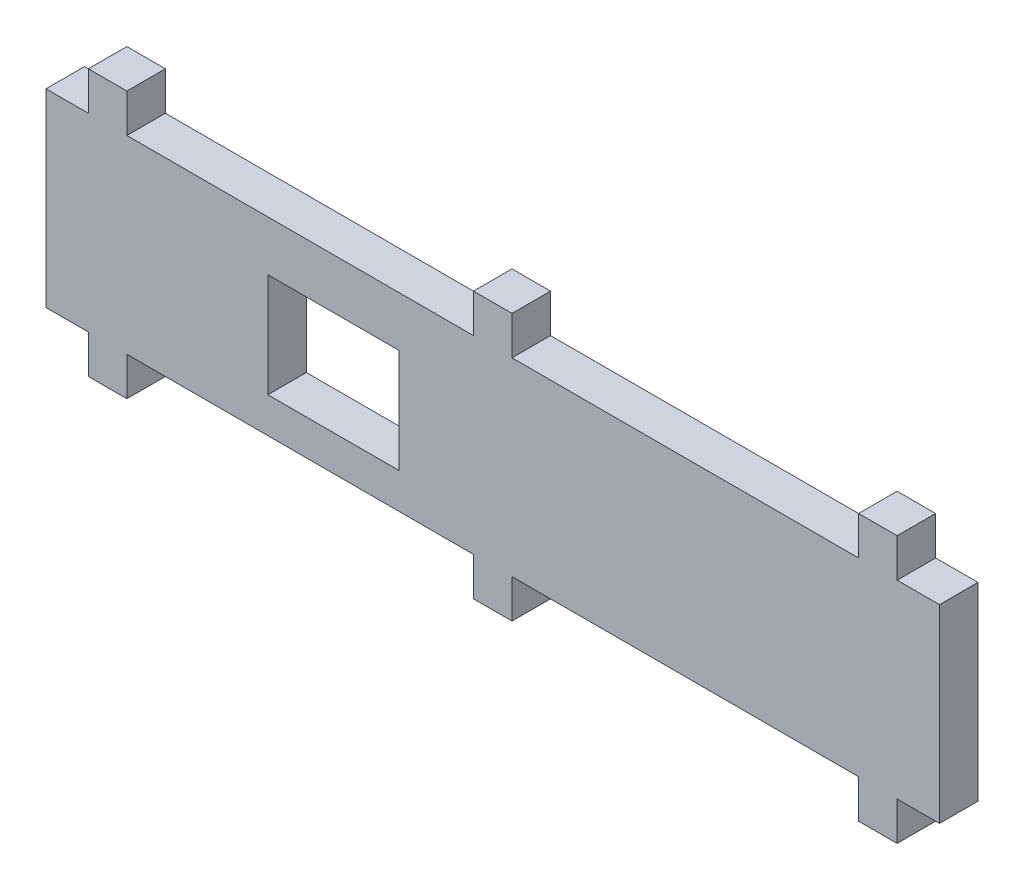
ISO-10303-21;
HEADER;
FILE_DESCRIPTION(('STEP AP214'),'2;1');
FILE_NAME('part.step','',(''),(''),'','','');
FILE_SCHEMA(('AUTOMOTIVE_DESIGN { 1 0 10303 214 1 1 1 1 }'));
ENDSEC;
DATA;
#1=APPLICATION_CONTEXT('core data for automotive mechanical design processes');
#2=APPLICATION_PROTOCOL_DEFINITION('international standard','automotive_design',2000,#1);
#3=PRODUCT_CONTEXT('',#1,'mechanical');
#4=PRODUCT('Part','Part','',(#3));
#5=PRODUCT_RELATED_PRODUCT_CATEGORY('part','',(#4));
#6=PRODUCT_DEFINITION_FORMATION('','',#4);
#7=PRODUCT_DEFINITION_CONTEXT('part definition',#1,'design');
#8=PRODUCT_DEFINITION('design','',#6,#7);
#9=PRODUCT_DEFINITION_SHAPE('','',#8);
#10=(LENGTH_UNIT() NAMED_UNIT(*) SI_UNIT(.MILLI.,.METRE.));
#11=(NAMED_UNIT(*) PLANE_ANGLE_UNIT() SI_UNIT($,.RADIAN.));
#12=(NAMED_UNIT(*) SI_UNIT($,.STERADIAN.) SOLID_ANGLE_UNIT());
#13=UNCERTAINTY_MEASURE_WITH_UNIT(LENGTH_MEASURE(1.E-05),#10,'distance_accuracy_value','');
#14=(GEOMETRIC_REPRESENTATION_CONTEXT(3) GLOBAL_UNCERTAINTY_ASSIGNED_CONTEXT((#13)) GLOBAL_UNIT_ASSIGNED_CONTEXT((#10,
#11,#12)) REPRESENTATION_CONTEXT('',''));
#15=CARTESIAN_POINT('',(0.,0.,0.));
#16=DIRECTION('',(0.,0.,1.));
#17=DIRECTION('',(1.,0.,0.));
#18=AXIS2_PLACEMENT_3D('',#15,#16,#17);
#19=CARTESIAN_POINT('',(-58.,-6.15,5.));
#20=DIRECTION('',(0.,1.,0.));
#21=DIRECTION('',(0.,0.,1.));
#22=AXIS2_PLACEMENT_3D('',#19,#20,#21);
#23=PLANE('',#22);
#24=DIRECTION('',(0.,0.,-1.));
#25=VECTOR('',#24,1.);
#26=CARTESIAN_POINT('',(47.5,-6.15,5.));
#27=LINE('',#26,#25);
#28=CARTESIAN_POINT('',(47.5,-6.15,5.));
#29=VERTEX_POINT('',#28);
#30=CARTESIAN_POINT('',(47.5,-6.15,0.));
#31=VERTEX_POINT('',#30);
#32=EDGE_CURVE('E368',#29,#31,#27,.T.);
#33=ORIENTED_EDGE('',*,*,#32,.F.);
#34=DIRECTION('',(1.,0.,0.));
#35=VECTOR('',#34,1.);
#36=CARTESIAN_POINT('',(-58.,-6.15,5.));
#37=LINE('',#36,#35);
#38=CARTESIAN_POINT('',(2.49999999999998,-6.15,5.));
#39=VERTEX_POINT('',#38);
#40=EDGE_CURVE('E487',#39,#29,#37,.T.);
#41=ORIENTED_EDGE('',*,*,#40,.F.);
#42=DIRECTION('',(0.,0.,1.));
#43=VECTOR('',#42,1.);
#44=CARTESIAN_POINT('',(2.5,-6.15,5.));
#45=LINE('',#44,#43);
#46=CARTESIAN_POINT('',(2.5,-6.15,0.));
#47=VERTEX_POINT('',#46);
#48=EDGE_CURVE('E433',#47,#39,#45,.T.);
#49=ORIENTED_EDGE('',*,*,#48,.F.);
#50=DIRECTION('',(1.,0.,0.));
#51=VECTOR('',#50,1.);
#52=CARTESIAN_POINT('',(-58.,-6.15,0.));
#53=LINE('',#52,#51);
#54=EDGE_CURVE('E482',#47,#31,#53,.T.);
#55=ORIENTED_EDGE('',*,*,#54,.T.);
#56=EDGE_LOOP('',(#33,#41,#49,#55));
#57=FACE_BOUND('',#56,.T.);
#58=ADVANCED_FACE('F33',(#57),#23,.F.);
#59=DIRECTION('',(0.,0.,1.));
#60=VECTOR('',#59,1.);
#61=CARTESIAN_POINT('',(52.5,-6.15,5.));
#62=LINE('',#61,#60);
#63=CARTESIAN_POINT('',(52.5,-6.15,0.));
#64=VERTEX_POINT('',#63);
#65=CARTESIAN_POINT('',(52.5,-6.15,5.));
#66=VERTEX_POINT('',#65);
#67=EDGE_CURVE('E373',#64,#66,#62,.T.);
#68=ORIENTED_EDGE('',*,*,#67,.F.);
#69=CARTESIAN_POINT('',(58.,-6.15,0.));
#70=VERTEX_POINT('',#69);
#71=EDGE_CURVE('E486',#64,#70,#53,.T.);
#72=ORIENTED_EDGE('',*,*,#71,.T.);
#73=DIRECTION('',(0.,0.,-1.));
#74=VECTOR('',#73,1.);
#75=CARTESIAN_POINT('',(58.,-6.15,5.));
#76=LINE('',#75,#74);
#77=CARTESIAN_POINT('',(58.,-6.15,5.));
#78=VERTEX_POINT('',#77);
#79=EDGE_CURVE('E495',#78,#70,#76,.T.);
#80=ORIENTED_EDGE('',*,*,#79,.F.);
#81=EDGE_CURVE('E532',#66,#78,#37,.T.);
#82=ORIENTED_EDGE('',*,*,#81,.F.);
#83=EDGE_LOOP('',(#68,#72,#80,#82));
#84=FACE_BOUND('',#83,.T.);
#85=ADVANCED_FACE('F555',(#84),#23,.F.);
#86=DIRECTION('',(0.,0.,-1.));
#87=VECTOR('',#86,1.);
#88=CARTESIAN_POINT('',(-2.5,-6.15,5.));
#89=LINE('',#88,#87);
#90=CARTESIAN_POINT('',(-2.50000000000002,-6.15,5.));
#91=VERTEX_POINT('',#90);
#92=CARTESIAN_POINT('',(-2.50000000000002,-6.15,0.));
#93=VERTEX_POINT('',#92);
#94=EDGE_CURVE('E428',#91,#93,#89,.T.);
#95=ORIENTED_EDGE('',*,*,#94,.F.);
#96=CARTESIAN_POINT('',(-47.5,-6.15,5.));
#97=VERTEX_POINT('',#96);
#98=EDGE_CURVE('E519',#97,#91,#37,.T.);
#99=ORIENTED_EDGE('',*,*,#98,.F.);
#100=DIRECTION('',(0.,0.,1.));
#101=VECTOR('',#100,1.);
#102=CARTESIAN_POINT('',(-47.5,-6.15,5.));
#103=LINE('',#102,#101);
#104=CARTESIAN_POINT('',(-47.5,-6.15,0.));
#105=VERTEX_POINT('',#104);
#106=EDGE_CURVE('E460',#105,#97,#103,.T.);
#107=ORIENTED_EDGE('',*,*,#106,.F.);
#108=EDGE_CURVE('E485',#105,#93,#53,.T.);
#109=ORIENTED_EDGE('',*,*,#108,.T.);
#110=EDGE_LOOP('',(#95,#99,#107,#109));
#111=FACE_BOUND('',#110,.T.);
#112=ADVANCED_FACE('F562',(#111),#23,.F.);
#113=DIRECTION('',(0.,0.,-1.));
#114=VECTOR('',#113,1.);
#115=CARTESIAN_POINT('',(-52.5,-6.15,5.));
#116=LINE('',#115,#114);
#117=CARTESIAN_POINT('',(-52.5,-6.15,5.));
#118=VERTEX_POINT('',#117);
#119=CARTESIAN_POINT('',(-52.5,-6.15,0.));
#120=VERTEX_POINT('',#119);
#121=EDGE_CURVE('E455',#118,#120,#116,.T.);
#122=ORIENTED_EDGE('',*,*,#121,.F.);
#123=CARTESIAN_POINT('',(-58.,-6.15,5.));
#124=VERTEX_POINT('',#123);
#125=EDGE_CURVE('E514',#124,#118,#37,.T.);
#126=ORIENTED_EDGE('',*,*,#125,.F.);
#127=DIRECTION('',(0.,0.,-1.));
#128=VECTOR('',#127,1.);
#129=CARTESIAN_POINT('',(-58.,-6.15,5.));
#130=LINE('',#129,#128);
#131=CARTESIAN_POINT('',(-58.,-6.15,0.));
#132=VERTEX_POINT('',#131);
#133=EDGE_CURVE('E505',#124,#132,#130,.T.);
#134=ORIENTED_EDGE('',*,*,#133,.T.);
#135=EDGE_CURVE('E503',#132,#120,#53,.T.);
#136=ORIENTED_EDGE('',*,*,#135,.T.);
#137=EDGE_LOOP('',(#122,#126,#134,#136));
#138=FACE_BOUND('',#137,.T.);
#139=ADVANCED_FACE('F558',(#138),#23,.F.);
#140=CARTESIAN_POINT('',(58.,-6.15,5.));
#141=DIRECTION('',(-1.,0.,0.));
#142=DIRECTION('',(0.,0.,1.));
#143=AXIS2_PLACEMENT_3D('',#140,#141,#142);
#144=PLANE('',#143);
#145=DIRECTION('',(0.,1.,0.));
#146=VECTOR('',#145,1.);
#147=CARTESIAN_POINT('',(58.,-6.15,0.));
#148=LINE('',#147,#146);
#149=CARTESIAN_POINT('',(58.,18.45,0.));
#150=VERTEX_POINT('',#149);
#151=EDGE_CURVE('E527',#70,#150,#148,.T.);
#152=ORIENTED_EDGE('',*,*,#151,.T.);
#153=DIRECTION('',(0.,0.,-1.));
#154=VECTOR('',#153,1.);
#155=CARTESIAN_POINT('',(58.,18.45,5.));
#156=LINE('',#155,#154);
#157=CARTESIAN_POINT('',(58.,18.45,5.));
#158=VERTEX_POINT('',#157);
#159=EDGE_CURVE('E355',#158,#150,#156,.T.);
#160=ORIENTED_EDGE('',*,*,#159,.F.);
#161=DIRECTION('',(0.,1.,0.));
#162=VECTOR('',#161,1.);
#163=CARTESIAN_POINT('',(58.,-6.15,5.));
#164=LINE('',#163,#162);
#165=EDGE_CURVE('E504',#78,#158,#164,.T.);
#166=ORIENTED_EDGE('',*,*,#165,.F.);
#167=ORIENTED_EDGE('',*,*,#79,.T.);
#168=EDGE_LOOP('',(#152,#160,#166,#167));
#169=FACE_BOUND('',#168,.T.);
#170=ADVANCED_FACE('F35',(#169),#144,.F.);
#171=CARTESIAN_POINT('',(-58.,-6.15,5.));
#172=DIRECTION('',(1.,0.,0.));
#173=DIRECTION('',(0.,0.,-1.));
#174=AXIS2_PLACEMENT_3D('',#171,#172,#173);
#175=PLANE('',#174);
#176=DIRECTION('',(0.,-1.,0.));
#177=VECTOR('',#176,1.);
#178=CARTESIAN_POINT('',(-58.,-6.15,0.));
#179=LINE('',#178,#177);
#180=CARTESIAN_POINT('',(-58.,18.45,0.));
#181=VERTEX_POINT('',#180);
#182=EDGE_CURVE('E493',#181,#132,#179,.T.);
#183=ORIENTED_EDGE('',*,*,#182,.T.);
#184=ORIENTED_EDGE('',*,*,#133,.F.);
#185=DIRECTION('',(0.,-1.,0.));
#186=VECTOR('',#185,1.);
#187=CARTESIAN_POINT('',(-58.,-6.15,5.));
#188=LINE('',#187,#186);
#189=CARTESIAN_POINT('',(-58.,18.45,5.));
#190=VERTEX_POINT('',#189);
#191=EDGE_CURVE('E526',#190,#124,#188,.T.);
#192=ORIENTED_EDGE('',*,*,#191,.F.);
#193=DIRECTION('',(0.,0.,-1.));
#194=VECTOR('',#193,1.);
#195=CARTESIAN_POINT('',(-58.,18.45,5.));
#196=LINE('',#195,#194);
#197=EDGE_CURVE('E366',#190,#181,#196,.T.);
#198=ORIENTED_EDGE('',*,*,#197,.T.);
#199=EDGE_LOOP('',(#183,#184,#192,#198));
#200=FACE_BOUND('',#199,.T.);
#201=ADVANCED_FACE('F570',(#200),#175,.F.);
#202=CARTESIAN_POINT('',(0.,0.,5.));
#203=DIRECTION('',(0.,0.,-1.));
#204=DIRECTION('',(-1.,0.,0.));
#205=AXIS2_PLACEMENT_3D('',#202,#203,#204);
#206=PLANE('',#205);
#207=DIRECTION('',(1.,0.,0.));
#208=VECTOR('',#207,1.);
#209=CARTESIAN_POINT('',(-29.2,-1.55,5.));
#210=LINE('',#209,#208);
#211=CARTESIAN_POINT('',(-29.2,-1.55,5.));
#212=VERTEX_POINT('',#211);
#213=CARTESIAN_POINT('',(-12.2,-1.55,5.));
#214=VERTEX_POINT('',#213);
#215=EDGE_CURVE('E253',#212,#214,#210,.T.);
#216=ORIENTED_EDGE('',*,*,#215,.F.);
#217=DIRECTION('',(0.,-1.,0.));
#218=VECTOR('',#217,1.);
#219=CARTESIAN_POINT('',(-29.2,-1.55,5.));
#220=LINE('',#219,#218);
#221=CARTESIAN_POINT('',(-29.2,11.95,5.));
#222=VERTEX_POINT('',#221);
#223=EDGE_CURVE('E48',#222,#212,#220,.T.);
#224=ORIENTED_EDGE('',*,*,#223,.F.);
#225=DIRECTION('',(-1.,0.,0.));
#226=VECTOR('',#225,1.);
#227=CARTESIAN_POINT('',(-29.2,11.95,5.));
#228=LINE('',#227,#226);
#229=CARTESIAN_POINT('',(-12.2,11.95,5.));
#230=VERTEX_POINT('',#229);
#231=EDGE_CURVE('E260',#230,#222,#228,.T.);
#232=ORIENTED_EDGE('',*,*,#231,.F.);
#233=DIRECTION('',(0.,1.,0.));
#234=VECTOR('',#233,1.);
#235=CARTESIAN_POINT('',(-12.2,-1.55,5.));
#236=LINE('',#235,#234);
#237=EDGE_CURVE('E244',#214,#230,#236,.T.);
#238=ORIENTED_EDGE('',*,*,#237,.F.);
#239=EDGE_LOOP('',(#216,#224,#232,#238));
#240=FACE_BOUND('',#239,.T.);
#241=ORIENTED_EDGE('',*,*,#165,.T.);
#242=DIRECTION('',(1.,0.,0.));
#243=VECTOR('',#242,1.);
#244=CARTESIAN_POINT('',(-58.,18.45,5.));
#245=LINE('',#244,#243);
#246=CARTESIAN_POINT('',(52.5,18.45,5.));
#247=VERTEX_POINT('',#246);
#248=EDGE_CURVE('E365',#247,#158,#245,.T.);
#249=ORIENTED_EDGE('',*,*,#248,.F.);
#250=DIRECTION('',(0.,-1.,0.));
#251=VECTOR('',#250,1.);
#252=CARTESIAN_POINT('',(52.5,23.45,5.));
#253=LINE('',#252,#251);
#254=CARTESIAN_POINT('',(52.5,23.45,5.));
#255=VERTEX_POINT('',#254);
#256=EDGE_CURVE('E287',#255,#247,#253,.T.);
#257=ORIENTED_EDGE('',*,*,#256,.F.);
#258=DIRECTION('',(-1.,0.,0.));
#259=VECTOR('',#258,1.);
#260=CARTESIAN_POINT('',(47.5,23.45,5.));
#261=LINE('',#260,#259);
#262=CARTESIAN_POINT('',(47.5,23.45,5.));
#263=VERTEX_POINT('',#262);
#264=EDGE_CURVE('E278',#255,#263,#261,.T.);
#265=ORIENTED_EDGE('',*,*,#264,.T.);
#266=DIRECTION('',(0.,-1.,0.));
#267=VECTOR('',#266,1.);
#268=CARTESIAN_POINT('',(47.5,23.45,5.));
#269=LINE('',#268,#267);
#270=CARTESIAN_POINT('',(47.5,18.45,5.));
#271=VERTEX_POINT('',#270);
#272=EDGE_CURVE('E281',#263,#271,#269,.T.);
#273=ORIENTED_EDGE('',*,*,#272,.T.);
#274=CARTESIAN_POINT('',(2.49999999999998,18.45,5.));
#275=VERTEX_POINT('',#274);
#276=EDGE_CURVE('E350',#275,#271,#245,.T.);
#277=ORIENTED_EDGE('',*,*,#276,.F.);
#278=DIRECTION('',(0.,-1.,0.));
#279=VECTOR('',#278,1.);
#280=CARTESIAN_POINT('',(2.5,23.45,5.));
#281=LINE('',#280,#279);
#282=CARTESIAN_POINT('',(2.5,23.45,5.));
#283=VERTEX_POINT('',#282);
#284=EDGE_CURVE('E311',#283,#275,#281,.T.);
#285=ORIENTED_EDGE('',*,*,#284,.F.);
#286=DIRECTION('',(-1.,0.,0.));
#287=VECTOR('',#286,1.);
#288=CARTESIAN_POINT('',(-2.5,23.45,5.));
#289=LINE('',#288,#287);
#290=CARTESIAN_POINT('',(-2.5,23.45,5.));
#291=VERTEX_POINT('',#290);
#292=EDGE_CURVE('E302',#283,#291,#289,.T.);
#293=ORIENTED_EDGE('',*,*,#292,.T.);
#294=DIRECTION('',(0.,-1.,0.));
#295=VECTOR('',#294,1.);
#296=CARTESIAN_POINT('',(-2.5,23.45,5.));
#297=LINE('',#296,#295);
#298=CARTESIAN_POINT('',(-2.50000000000002,18.45,5.));
#299=VERTEX_POINT('',#298);
#300=EDGE_CURVE('E305',#291,#299,#297,.T.);
#301=ORIENTED_EDGE('',*,*,#300,.T.);
#302=CARTESIAN_POINT('',(-47.5,18.45,5.));
#303=VERTEX_POINT('',#302);
#304=EDGE_CURVE('E382',#303,#299,#245,.T.);
#305=ORIENTED_EDGE('',*,*,#304,.F.);
#306=DIRECTION('',(0.,-1.,0.));
#307=VECTOR('',#306,1.);
#308=CARTESIAN_POINT('',(-47.5,23.45,5.));
#309=LINE('',#308,#307);
#310=CARTESIAN_POINT('',(-47.5,23.45,5.));
#311=VERTEX_POINT('',#310);
#312=EDGE_CURVE('E341',#311,#303,#309,.T.);
#313=ORIENTED_EDGE('',*,*,#312,.F.);
#314=DIRECTION('',(-1.,0.,0.));
#315=VECTOR('',#314,1.);
#316=CARTESIAN_POINT('',(-52.5,23.45,5.));
#317=LINE('',#316,#315);
#318=CARTESIAN_POINT('',(-52.5,23.45,5.));
#319=VERTEX_POINT('',#318);
#320=EDGE_CURVE('E326',#311,#319,#317,.T.);
#321=ORIENTED_EDGE('',*,*,#320,.T.);
#322=DIRECTION('',(0.,-1.,0.));
#323=VECTOR('',#322,1.);
#324=CARTESIAN_POINT('',(-52.5,23.45,5.));
#325=LINE('',#324,#323);
#326=CARTESIAN_POINT('',(-52.5,18.45,5.));
#327=VERTEX_POINT('',#326);
#328=EDGE_CURVE('E329',#319,#327,#325,.T.);
#329=ORIENTED_EDGE('',*,*,#328,.T.);
#330=EDGE_CURVE('E376',#190,#327,#245,.T.);
#331=ORIENTED_EDGE('',*,*,#330,.F.);
#332=ORIENTED_EDGE('',*,*,#191,.T.);
#333=ORIENTED_EDGE('',*,*,#125,.T.);
#334=DIRECTION('',(0.,1.,0.));
#335=VECTOR('',#334,1.);
#336=CARTESIAN_POINT('',(-52.5,-11.15,5.));
#337=LINE('',#336,#335);
#338=CARTESIAN_POINT('',(-52.5,-11.15,5.));
#339=VERTEX_POINT('',#338);
#340=EDGE_CURVE('E466',#339,#118,#337,.T.);
#341=ORIENTED_EDGE('',*,*,#340,.F.);
#342=DIRECTION('',(-1.,0.,0.));
#343=VECTOR('',#342,1.);
#344=CARTESIAN_POINT('',(-52.5,-11.15,5.));
#345=LINE('',#344,#343);
#346=CARTESIAN_POINT('',(-47.5,-11.15,5.));
#347=VERTEX_POINT('',#346);
#348=EDGE_CURVE('E464',#347,#339,#345,.T.);
#349=ORIENTED_EDGE('',*,*,#348,.F.);
#350=DIRECTION('',(0.,1.,0.));
#351=VECTOR('',#350,1.);
#352=CARTESIAN_POINT('',(-47.5,-11.15,5.));
#353=LINE('',#352,#351);
#354=EDGE_CURVE('E479',#347,#97,#353,.T.);
#355=ORIENTED_EDGE('',*,*,#354,.T.);
#356=ORIENTED_EDGE('',*,*,#98,.T.);
#357=DIRECTION('',(0.,1.,0.));
#358=VECTOR('',#357,1.);
#359=CARTESIAN_POINT('',(-2.5,-11.15,5.));
#360=LINE('',#359,#358);
#361=CARTESIAN_POINT('',(-2.5,-11.15,5.));
#362=VERTEX_POINT('',#361);
#363=EDGE_CURVE('E439',#362,#91,#360,.T.);
#364=ORIENTED_EDGE('',*,*,#363,.F.);
#365=DIRECTION('',(-1.,0.,0.));
#366=VECTOR('',#365,1.);
#367=CARTESIAN_POINT('',(-2.5,-11.15,5.));
#368=LINE('',#367,#366);
#369=CARTESIAN_POINT('',(2.5,-11.15,5.));
#370=VERTEX_POINT('',#369);
#371=EDGE_CURVE('E437',#370,#362,#368,.T.);
#372=ORIENTED_EDGE('',*,*,#371,.F.);
#373=DIRECTION('',(0.,1.,0.));
#374=VECTOR('',#373,1.);
#375=CARTESIAN_POINT('',(2.5,-11.15,5.));
#376=LINE('',#375,#374);
#377=EDGE_CURVE('E446',#370,#39,#376,.T.);
#378=ORIENTED_EDGE('',*,*,#377,.T.);
#379=ORIENTED_EDGE('',*,*,#40,.T.);
#380=DIRECTION('',(0.,1.,0.));
#381=VECTOR('',#380,1.);
#382=CARTESIAN_POINT('',(47.5,-11.15,5.));
#383=LINE('',#382,#381);
#384=CARTESIAN_POINT('',(47.5,-11.15,5.));
#385=VERTEX_POINT('',#384);
#386=EDGE_CURVE('E413',#385,#29,#383,.T.);
#387=ORIENTED_EDGE('',*,*,#386,.F.);
#388=DIRECTION('',(-1.,0.,0.));
#389=VECTOR('',#388,1.);
#390=CARTESIAN_POINT('',(47.5,-11.15,5.));
#391=LINE('',#390,#389);
#392=CARTESIAN_POINT('',(52.5,-11.15,5.));
#393=VERTEX_POINT('',#392);
#394=EDGE_CURVE('E412',#393,#385,#391,.T.);
#395=ORIENTED_EDGE('',*,*,#394,.F.);
#396=DIRECTION('',(0.,1.,0.));
#397=VECTOR('',#396,1.);
#398=CARTESIAN_POINT('',(52.5,-11.15,5.));
#399=LINE('',#398,#397);
#400=EDGE_CURVE('E419',#393,#66,#399,.T.);
#401=ORIENTED_EDGE('',*,*,#400,.T.);
#402=ORIENTED_EDGE('',*,*,#81,.T.);
#403=EDGE_LOOP('',(#241,#249,#257,#265,#273,#277,#285,#293,#301,#305,#313,#321,#329,#331,#332,
#333,#341,#349,#355,#356,#364,#372,#378,#379,#387,#395,#401,#402));
#404=FACE_BOUND('',#403,.T.);
#405=ADVANCED_FACE('F257',(#240,#404),#206,.F.);
#406=CARTESIAN_POINT('',(0.,0.,0.));
#407=DIRECTION('',(0.,0.,-1.));
#408=DIRECTION('',(-1.,0.,0.));
#409=AXIS2_PLACEMENT_3D('',#406,#407,#408);
#410=PLANE('',#409);
#411=DIRECTION('',(0.,1.,0.));
#412=VECTOR('',#411,1.);
#413=CARTESIAN_POINT('',(-29.2,0.,0.));
#414=LINE('',#413,#412);
#415=CARTESIAN_POINT('',(-29.2,-1.55,0.));
#416=VERTEX_POINT('',#415);
#417=CARTESIAN_POINT('',(-29.2,11.95,0.));
#418=VERTEX_POINT('',#417);
#419=EDGE_CURVE('E11',#416,#418,#414,.T.);
#420=ORIENTED_EDGE('',*,*,#419,.F.);
#421=DIRECTION('',(-1.,0.,0.));
#422=VECTOR('',#421,1.);
#423=CARTESIAN_POINT('',(0.,-1.55,0.));
#424=LINE('',#423,#422);
#425=CARTESIAN_POINT('',(-12.2,-1.55,0.));
#426=VERTEX_POINT('',#425);
#427=EDGE_CURVE('E507',#426,#416,#424,.T.);
#428=ORIENTED_EDGE('',*,*,#427,.F.);
#429=DIRECTION('',(0.,-1.,0.));
#430=VECTOR('',#429,1.);
#431=CARTESIAN_POINT('',(-12.2,0.,0.));
#432=LINE('',#431,#430);
#433=CARTESIAN_POINT('',(-12.2,11.95,0.));
#434=VERTEX_POINT('',#433);
#435=EDGE_CURVE('E247',#434,#426,#432,.T.);
#436=ORIENTED_EDGE('',*,*,#435,.F.);
#437=DIRECTION('',(1.,0.,0.));
#438=VECTOR('',#437,1.);
#439=CARTESIAN_POINT('',(0.,11.95,0.));
#440=LINE('',#439,#438);
#441=EDGE_CURVE('E41',#418,#434,#440,.T.);
#442=ORIENTED_EDGE('',*,*,#441,.F.);
#443=EDGE_LOOP('',(#420,#428,#436,#442));
#444=FACE_BOUND('',#443,.T.);
#445=ORIENTED_EDGE('',*,*,#151,.F.);
#446=ORIENTED_EDGE('',*,*,#71,.F.);
#447=DIRECTION('',(0.,1.,0.));
#448=VECTOR('',#447,1.);
#449=CARTESIAN_POINT('',(52.5,-11.15,0.));
#450=LINE('',#449,#448);
#451=CARTESIAN_POINT('',(52.5,-11.15,0.));
#452=VERTEX_POINT('',#451);
#453=EDGE_CURVE('E422',#452,#64,#450,.T.);
#454=ORIENTED_EDGE('',*,*,#453,.F.);
#455=DIRECTION('',(1.,0.,0.));
#456=VECTOR('',#455,1.);
#457=CARTESIAN_POINT('',(47.5,-11.15,0.));
#458=LINE('',#457,#456);
#459=CARTESIAN_POINT('',(47.5,-11.15,0.));
#460=VERTEX_POINT('',#459);
#461=EDGE_CURVE('E408',#460,#452,#458,.T.);
#462=ORIENTED_EDGE('',*,*,#461,.F.);
#463=DIRECTION('',(0.,1.,0.));
#464=VECTOR('',#463,1.);
#465=CARTESIAN_POINT('',(47.5,-11.15,0.));
#466=LINE('',#465,#464);
#467=EDGE_CURVE('E425',#460,#31,#466,.T.);
#468=ORIENTED_EDGE('',*,*,#467,.T.);
#469=ORIENTED_EDGE('',*,*,#54,.F.);
#470=DIRECTION('',(0.,1.,0.));
#471=VECTOR('',#470,1.);
#472=CARTESIAN_POINT('',(2.5,-11.15,0.));
#473=LINE('',#472,#471);
#474=CARTESIAN_POINT('',(2.5,-11.15,0.));
#475=VERTEX_POINT('',#474);
#476=EDGE_CURVE('E449',#475,#47,#473,.T.);
#477=ORIENTED_EDGE('',*,*,#476,.F.);
#478=DIRECTION('',(1.,0.,0.));
#479=VECTOR('',#478,1.);
#480=CARTESIAN_POINT('',(-2.5,-11.15,0.));
#481=LINE('',#480,#479);
#482=CARTESIAN_POINT('',(-2.5,-11.15,0.));
#483=VERTEX_POINT('',#482);
#484=EDGE_CURVE('E432',#483,#475,#481,.T.);
#485=ORIENTED_EDGE('',*,*,#484,.F.);
#486=DIRECTION('',(0.,1.,0.));
#487=VECTOR('',#486,1.);
#488=CARTESIAN_POINT('',(-2.5,-11.15,0.));
#489=LINE('',#488,#487);
#490=EDGE_CURVE('E452',#483,#93,#489,.T.);
#491=ORIENTED_EDGE('',*,*,#490,.T.);
#492=ORIENTED_EDGE('',*,*,#108,.F.);
#493=DIRECTION('',(0.,1.,0.));
#494=VECTOR('',#493,1.);
#495=CARTESIAN_POINT('',(-47.5,-11.15,0.));
#496=LINE('',#495,#494);
#497=CARTESIAN_POINT('',(-47.5,-11.15,0.));
#498=VERTEX_POINT('',#497);
#499=EDGE_CURVE('E589',#498,#105,#496,.T.);
#500=ORIENTED_EDGE('',*,*,#499,.F.);
#501=DIRECTION('',(1.,0.,0.));
#502=VECTOR('',#501,1.);
#503=CARTESIAN_POINT('',(-52.5,-11.15,0.));
#504=LINE('',#503,#502);
#505=CARTESIAN_POINT('',(-52.5,-11.15,0.));
#506=VERTEX_POINT('',#505);
#507=EDGE_CURVE('E459',#506,#498,#504,.T.);
#508=ORIENTED_EDGE('',*,*,#507,.F.);
#509=DIRECTION('',(0.,1.,0.));
#510=VECTOR('',#509,1.);
#511=CARTESIAN_POINT('',(-52.5,-11.15,0.));
#512=LINE('',#511,#510);
#513=EDGE_CURVE('E577',#506,#120,#512,.T.);
#514=ORIENTED_EDGE('',*,*,#513,.T.);
#515=ORIENTED_EDGE('',*,*,#135,.F.);
#516=ORIENTED_EDGE('',*,*,#182,.F.);
#517=DIRECTION('',(1.,0.,0.));
#518=VECTOR('',#517,1.);
#519=CARTESIAN_POINT('',(-58.,18.45,0.));
#520=LINE('',#519,#518);
#521=CARTESIAN_POINT('',(-52.5,18.45,0.));
#522=VERTEX_POINT('',#521);
#523=EDGE_CURVE('E363',#181,#522,#520,.T.);
#524=ORIENTED_EDGE('',*,*,#523,.T.);
#525=DIRECTION('',(0.,-1.,0.));
#526=VECTOR('',#525,1.);
#527=CARTESIAN_POINT('',(-52.5,23.45,0.));
#528=LINE('',#527,#526);
#529=CARTESIAN_POINT('',(-52.5,23.45,0.));
#530=VERTEX_POINT('',#529);
#531=EDGE_CURVE('E396',#530,#522,#528,.T.);
#532=ORIENTED_EDGE('',*,*,#531,.F.);
#533=DIRECTION('',(1.,0.,0.));
#534=VECTOR('',#533,1.);
#535=CARTESIAN_POINT('',(-52.5,23.45,0.));
#536=LINE('',#535,#534);
#537=CARTESIAN_POINT('',(-47.5,23.45,0.));
#538=VERTEX_POINT('',#537);
#539=EDGE_CURVE('E320',#530,#538,#536,.T.);
#540=ORIENTED_EDGE('',*,*,#539,.T.);
#541=DIRECTION('',(0.,-1.,0.));
#542=VECTOR('',#541,1.);
#543=CARTESIAN_POINT('',(-47.5,23.45,0.));
#544=LINE('',#543,#542);
#545=CARTESIAN_POINT('',(-47.5,18.45,0.));
#546=VERTEX_POINT('',#545);
#547=EDGE_CURVE('E392',#538,#546,#544,.T.);
#548=ORIENTED_EDGE('',*,*,#547,.T.);
#549=CARTESIAN_POINT('',(-2.50000000000002,18.45,0.));
#550=VERTEX_POINT('',#549);
#551=EDGE_CURVE('E348',#546,#550,#520,.T.);
#552=ORIENTED_EDGE('',*,*,#551,.T.);
#553=DIRECTION('',(0.,-1.,0.));
#554=VECTOR('',#553,1.);
#555=CARTESIAN_POINT('',(-2.5,23.45,0.));
#556=LINE('',#555,#554);
#557=CARTESIAN_POINT('',(-2.5,23.45,0.));
#558=VERTEX_POINT('',#557);
#559=EDGE_CURVE('E315',#558,#550,#556,.T.);
#560=ORIENTED_EDGE('',*,*,#559,.F.);
#561=DIRECTION('',(1.,0.,0.));
#562=VECTOR('',#561,1.);
#563=CARTESIAN_POINT('',(-2.5,23.45,0.));
#564=LINE('',#563,#562);
#565=CARTESIAN_POINT('',(2.5,23.45,0.));
#566=VERTEX_POINT('',#565);
#567=EDGE_CURVE('E296',#558,#566,#564,.T.);
#568=ORIENTED_EDGE('',*,*,#567,.T.);
#569=DIRECTION('',(0.,-1.,0.));
#570=VECTOR('',#569,1.);
#571=CARTESIAN_POINT('',(2.5,23.45,0.));
#572=LINE('',#571,#570);
#573=CARTESIAN_POINT('',(2.5,18.45,0.));
#574=VERTEX_POINT('',#573);
#575=EDGE_CURVE('E313',#566,#574,#572,.T.);
#576=ORIENTED_EDGE('',*,*,#575,.T.);
#577=CARTESIAN_POINT('',(47.5,18.45,0.));
#578=VERTEX_POINT('',#577);
#579=EDGE_CURVE('E344',#574,#578,#520,.T.);
#580=ORIENTED_EDGE('',*,*,#579,.T.);
#581=DIRECTION('',(0.,-1.,0.));
#582=VECTOR('',#581,1.);
#583=CARTESIAN_POINT('',(47.5,23.45,0.));
#584=LINE('',#583,#582);
#585=CARTESIAN_POINT('',(47.5,23.45,0.));
#586=VERTEX_POINT('',#585);
#587=EDGE_CURVE('E291',#586,#578,#584,.T.);
#588=ORIENTED_EDGE('',*,*,#587,.F.);
#589=DIRECTION('',(1.,0.,0.));
#590=VECTOR('',#589,1.);
#591=CARTESIAN_POINT('',(47.5,23.45,0.));
#592=LINE('',#591,#590);
#593=CARTESIAN_POINT('',(52.5,23.45,0.));
#594=VERTEX_POINT('',#593);
#595=EDGE_CURVE('E272',#586,#594,#592,.T.);
#596=ORIENTED_EDGE('',*,*,#595,.T.);
#597=DIRECTION('',(0.,-1.,0.));
#598=VECTOR('',#597,1.);
#599=CARTESIAN_POINT('',(52.5,23.45,0.));
#600=LINE('',#599,#598);
#601=CARTESIAN_POINT('',(52.5,18.45,0.));
#602=VERTEX_POINT('',#601);
#603=EDGE_CURVE('E289',#594,#602,#600,.T.);
#604=ORIENTED_EDGE('',*,*,#603,.T.);
#605=EDGE_CURVE('E349',#602,#150,#520,.T.);
#606=ORIENTED_EDGE('',*,*,#605,.T.);
#607=EDGE_LOOP('',(#445,#446,#454,#462,#468,#469,#477,#485,#491,#492,#500,#508,#514,#515,#516,
#524,#532,#540,#548,#552,#560,#568,#576,#580,#588,#596,#604,#606));
#608=FACE_BOUND('',#607,.T.);
#609=ADVANCED_FACE('F540',(#444,#608),#410,.T.);
#610=CARTESIAN_POINT('',(-52.5,-11.15,5.));
#611=DIRECTION('',(1.,0.,0.));
#612=DIRECTION('',(0.,0.,-1.));
#613=AXIS2_PLACEMENT_3D('',#610,#611,#612);
#614=PLANE('',#613);
#615=ORIENTED_EDGE('',*,*,#121,.T.);
#616=ORIENTED_EDGE('',*,*,#513,.F.);
#617=DIRECTION('',(0.,0.,-1.));
#618=VECTOR('',#617,1.);
#619=CARTESIAN_POINT('',(-52.5,-11.15,5.));
#620=LINE('',#619,#618);
#621=EDGE_CURVE('E456',#339,#506,#620,.T.);
#622=ORIENTED_EDGE('',*,*,#621,.F.);
#623=ORIENTED_EDGE('',*,*,#340,.T.);
#624=EDGE_LOOP('',(#615,#616,#622,#623));
#625=FACE_BOUND('',#624,.T.);
#626=ADVANCED_FACE('F575',(#625),#614,.F.);
#627=CARTESIAN_POINT('',(-47.5,-11.15,5.));
#628=DIRECTION('',(-1.,0.,0.));
#629=DIRECTION('',(0.,0.,1.));
#630=AXIS2_PLACEMENT_3D('',#627,#628,#629);
#631=PLANE('',#630);
#632=ORIENTED_EDGE('',*,*,#106,.T.);
#633=ORIENTED_EDGE('',*,*,#354,.F.);
#634=DIRECTION('',(0.,0.,1.));
#635=VECTOR('',#634,1.);
#636=CARTESIAN_POINT('',(-47.5,-11.15,5.));
#637=LINE('',#636,#635);
#638=EDGE_CURVE('E462',#498,#347,#637,.T.);
#639=ORIENTED_EDGE('',*,*,#638,.F.);
#640=ORIENTED_EDGE('',*,*,#499,.T.);
#641=EDGE_LOOP('',(#632,#633,#639,#640));
#642=FACE_BOUND('',#641,.T.);
#643=ADVANCED_FACE('F588',(#642),#631,.F.);
#644=CARTESIAN_POINT('',(0.,-11.15,0.));
#645=DIRECTION('',(0.,-1.,0.));
#646=DIRECTION('',(0.,0.,-1.));
#647=AXIS2_PLACEMENT_3D('',#644,#645,#646);
#648=PLANE('',#647);
#649=ORIENTED_EDGE('',*,*,#621,.T.);
#650=ORIENTED_EDGE('',*,*,#507,.T.);
#651=ORIENTED_EDGE('',*,*,#638,.T.);
#652=ORIENTED_EDGE('',*,*,#348,.T.);
#653=EDGE_LOOP('',(#649,#650,#651,#652));
#654=FACE_BOUND('',#653,.T.);
#655=ADVANCED_FACE('F582',(#654),#648,.T.);
#656=CARTESIAN_POINT('',(-2.5,-11.15,5.));
#657=DIRECTION('',(1.,0.,0.));
#658=DIRECTION('',(0.,0.,-1.));
#659=AXIS2_PLACEMENT_3D('',#656,#657,#658);
#660=PLANE('',#659);
#661=ORIENTED_EDGE('',*,*,#94,.T.);
#662=ORIENTED_EDGE('',*,*,#490,.F.);
#663=DIRECTION('',(0.,0.,-1.));
#664=VECTOR('',#663,1.);
#665=CARTESIAN_POINT('',(-2.5,-11.15,5.));
#666=LINE('',#665,#664);
#667=EDGE_CURVE('E429',#362,#483,#666,.T.);
#668=ORIENTED_EDGE('',*,*,#667,.F.);
#669=ORIENTED_EDGE('',*,*,#363,.T.);
#670=EDGE_LOOP('',(#661,#662,#668,#669));
#671=FACE_BOUND('',#670,.T.);
#672=ADVANCED_FACE('F625',(#671),#660,.F.);
#673=CARTESIAN_POINT('',(2.5,-11.15,5.));
#674=DIRECTION('',(-1.,0.,0.));
#675=DIRECTION('',(0.,0.,1.));
#676=AXIS2_PLACEMENT_3D('',#673,#674,#675);
#677=PLANE('',#676);
#678=ORIENTED_EDGE('',*,*,#48,.T.);
#679=ORIENTED_EDGE('',*,*,#377,.F.);
#680=DIRECTION('',(0.,0.,1.));
#681=VECTOR('',#680,1.);
#682=CARTESIAN_POINT('',(2.5,-11.15,5.));
#683=LINE('',#682,#681);
#684=EDGE_CURVE('E435',#475,#370,#683,.T.);
#685=ORIENTED_EDGE('',*,*,#684,.F.);
#686=ORIENTED_EDGE('',*,*,#476,.T.);
#687=EDGE_LOOP('',(#678,#679,#685,#686));
#688=FACE_BOUND('',#687,.T.);
#689=ADVANCED_FACE('F616',(#688),#677,.F.);
#690=CARTESIAN_POINT('',(0.,-11.15,0.));
#691=DIRECTION('',(0.,-1.,0.));
#692=DIRECTION('',(0.,0.,-1.));
#693=AXIS2_PLACEMENT_3D('',#690,#691,#692);
#694=PLANE('',#693);
#695=ORIENTED_EDGE('',*,*,#667,.T.);
#696=ORIENTED_EDGE('',*,*,#484,.T.);
#697=ORIENTED_EDGE('',*,*,#684,.T.);
#698=ORIENTED_EDGE('',*,*,#371,.T.);
#699=EDGE_LOOP('',(#695,#696,#697,#698));
#700=FACE_BOUND('',#699,.T.);
#701=ADVANCED_FACE('F619',(#700),#694,.T.);
#702=CARTESIAN_POINT('',(47.5,-11.15,5.));
#703=DIRECTION('',(1.,0.,0.));
#704=DIRECTION('',(0.,0.,-1.));
#705=AXIS2_PLACEMENT_3D('',#702,#703,#704);
#706=PLANE('',#705);
#707=ORIENTED_EDGE('',*,*,#32,.T.);
#708=ORIENTED_EDGE('',*,*,#467,.F.);
#709=DIRECTION('',(0.,0.,-1.));
#710=VECTOR('',#709,1.);
#711=CARTESIAN_POINT('',(47.5,-11.15,5.));
#712=LINE('',#711,#710);
#713=EDGE_CURVE('E405',#385,#460,#712,.T.);
#714=ORIENTED_EDGE('',*,*,#713,.F.);
#715=ORIENTED_EDGE('',*,*,#386,.T.);
#716=EDGE_LOOP('',(#707,#708,#714,#715));
#717=FACE_BOUND('',#716,.T.);
#718=ADVANCED_FACE('F609',(#717),#706,.F.);
#719=CARTESIAN_POINT('',(52.5,-11.15,5.));
#720=DIRECTION('',(-1.,0.,0.));
#721=DIRECTION('',(0.,0.,1.));
#722=AXIS2_PLACEMENT_3D('',#719,#720,#721);
#723=PLANE('',#722);
#724=ORIENTED_EDGE('',*,*,#67,.T.);
#725=ORIENTED_EDGE('',*,*,#400,.F.);
#726=DIRECTION('',(0.,0.,1.));
#727=VECTOR('',#726,1.);
#728=CARTESIAN_POINT('',(52.5,-11.15,5.));
#729=LINE('',#728,#727);
#730=EDGE_CURVE('E410',#452,#393,#729,.T.);
#731=ORIENTED_EDGE('',*,*,#730,.F.);
#732=ORIENTED_EDGE('',*,*,#453,.T.);
#733=EDGE_LOOP('',(#724,#725,#731,#732));
#734=FACE_BOUND('',#733,.T.);
#735=ADVANCED_FACE('F601',(#734),#723,.F.);
#736=CARTESIAN_POINT('',(0.,-11.15,0.));
#737=DIRECTION('',(0.,-1.,0.));
#738=DIRECTION('',(0.,0.,-1.));
#739=AXIS2_PLACEMENT_3D('',#736,#737,#738);
#740=PLANE('',#739);
#741=ORIENTED_EDGE('',*,*,#713,.T.);
#742=ORIENTED_EDGE('',*,*,#461,.T.);
#743=ORIENTED_EDGE('',*,*,#730,.T.);
#744=ORIENTED_EDGE('',*,*,#394,.T.);
#745=EDGE_LOOP('',(#741,#742,#743,#744));
#746=FACE_BOUND('',#745,.T.);
#747=ADVANCED_FACE('F604',(#746),#740,.T.);
#748=CARTESIAN_POINT('',(-58.,18.45,5.));
#749=DIRECTION('',(0.,-1.,0.));
#750=DIRECTION('',(0.,0.,1.));
#751=AXIS2_PLACEMENT_3D('',#748,#749,#750);
#752=PLANE('',#751);
#753=DIRECTION('',(0.,0.,-1.));
#754=VECTOR('',#753,1.);
#755=CARTESIAN_POINT('',(47.5,18.45,5.));
#756=LINE('',#755,#754);
#757=EDGE_CURVE('E267',#271,#578,#756,.T.);
#758=ORIENTED_EDGE('',*,*,#757,.T.);
#759=ORIENTED_EDGE('',*,*,#579,.F.);
#760=DIRECTION('',(0.,0.,1.));
#761=VECTOR('',#760,1.);
#762=CARTESIAN_POINT('',(2.5,18.45,5.));
#763=LINE('',#762,#761);
#764=EDGE_CURVE('E297',#574,#275,#763,.T.);
#765=ORIENTED_EDGE('',*,*,#764,.T.);
#766=ORIENTED_EDGE('',*,*,#276,.T.);
#767=EDGE_LOOP('',(#758,#759,#765,#766));
#768=FACE_BOUND('',#767,.T.);
#769=ADVANCED_FACE('F643',(#768),#752,.F.);
#770=DIRECTION('',(0.,0.,1.));
#771=VECTOR('',#770,1.);
#772=CARTESIAN_POINT('',(52.5,18.45,5.));
#773=LINE('',#772,#771);
#774=EDGE_CURVE('E273',#602,#247,#773,.T.);
#775=ORIENTED_EDGE('',*,*,#774,.T.);
#776=ORIENTED_EDGE('',*,*,#248,.T.);
#777=ORIENTED_EDGE('',*,*,#159,.T.);
#778=ORIENTED_EDGE('',*,*,#605,.F.);
#779=EDGE_LOOP('',(#775,#776,#777,#778));
#780=FACE_BOUND('',#779,.T.);
#781=ADVANCED_FACE('F628',(#780),#752,.F.);
#782=DIRECTION('',(0.,0.,-1.));
#783=VECTOR('',#782,1.);
#784=CARTESIAN_POINT('',(-2.5,18.45,5.));
#785=LINE('',#784,#783);
#786=EDGE_CURVE('E293',#299,#550,#785,.T.);
#787=ORIENTED_EDGE('',*,*,#786,.T.);
#788=ORIENTED_EDGE('',*,*,#551,.F.);
#789=DIRECTION('',(0.,0.,1.));
#790=VECTOR('',#789,1.);
#791=CARTESIAN_POINT('',(-47.5,18.45,5.));
#792=LINE('',#791,#790);
#793=EDGE_CURVE('E321',#546,#303,#792,.T.);
#794=ORIENTED_EDGE('',*,*,#793,.T.);
#795=ORIENTED_EDGE('',*,*,#304,.T.);
#796=EDGE_LOOP('',(#787,#788,#794,#795));
#797=FACE_BOUND('',#796,.T.);
#798=ADVANCED_FACE('F661',(#797),#752,.F.);
#799=DIRECTION('',(0.,0.,-1.));
#800=VECTOR('',#799,1.);
#801=CARTESIAN_POINT('',(-52.5,18.45,5.));
#802=LINE('',#801,#800);
#803=EDGE_CURVE('E317',#327,#522,#802,.T.);
#804=ORIENTED_EDGE('',*,*,#803,.T.);
#805=ORIENTED_EDGE('',*,*,#523,.F.);
#806=ORIENTED_EDGE('',*,*,#197,.F.);
#807=ORIENTED_EDGE('',*,*,#330,.T.);
#808=EDGE_LOOP('',(#804,#805,#806,#807));
#809=FACE_BOUND('',#808,.T.);
#810=ADVANCED_FACE('F674',(#809),#752,.F.);
#811=CARTESIAN_POINT('',(-52.5,23.45,5.));
#812=DIRECTION('',(1.,0.,0.));
#813=DIRECTION('',(0.,0.,-1.));
#814=AXIS2_PLACEMENT_3D('',#811,#812,#813);
#815=PLANE('',#814);
#816=ORIENTED_EDGE('',*,*,#803,.F.);
#817=ORIENTED_EDGE('',*,*,#328,.F.);
#818=DIRECTION('',(0.,0.,-1.));
#819=VECTOR('',#818,1.);
#820=CARTESIAN_POINT('',(-52.5,23.45,5.));
#821=LINE('',#820,#819);
#822=EDGE_CURVE('E318',#319,#530,#821,.T.);
#823=ORIENTED_EDGE('',*,*,#822,.T.);
#824=ORIENTED_EDGE('',*,*,#531,.T.);
#825=EDGE_LOOP('',(#816,#817,#823,#824));
#826=FACE_BOUND('',#825,.T.);
#827=ADVANCED_FACE('F673',(#826),#815,.F.);
#828=CARTESIAN_POINT('',(-47.5,23.45,5.));
#829=DIRECTION('',(-1.,0.,0.));
#830=DIRECTION('',(0.,0.,1.));
#831=AXIS2_PLACEMENT_3D('',#828,#829,#830);
#832=PLANE('',#831);
#833=ORIENTED_EDGE('',*,*,#793,.F.);
#834=ORIENTED_EDGE('',*,*,#547,.F.);
#835=DIRECTION('',(0.,0.,1.));
#836=VECTOR('',#835,1.);
#837=CARTESIAN_POINT('',(-47.5,23.45,5.));
#838=LINE('',#837,#836);
#839=EDGE_CURVE('E324',#538,#311,#838,.T.);
#840=ORIENTED_EDGE('',*,*,#839,.T.);
#841=ORIENTED_EDGE('',*,*,#312,.T.);
#842=EDGE_LOOP('',(#833,#834,#840,#841));
#843=FACE_BOUND('',#842,.T.);
#844=ADVANCED_FACE('F667',(#843),#832,.F.);
#845=CARTESIAN_POINT('',(0.,23.45,0.));
#846=DIRECTION('',(0.,1.,0.));
#847=DIRECTION('',(0.,0.,-1.));
#848=AXIS2_PLACEMENT_3D('',#845,#846,#847);
#849=PLANE('',#848);
#850=ORIENTED_EDGE('',*,*,#822,.F.);
#851=ORIENTED_EDGE('',*,*,#320,.F.);
#852=ORIENTED_EDGE('',*,*,#839,.F.);
#853=ORIENTED_EDGE('',*,*,#539,.F.);
#854=EDGE_LOOP('',(#850,#851,#852,#853));
#855=FACE_BOUND('',#854,.T.);
#856=ADVANCED_FACE('F671',(#855),#849,.T.);
#857=CARTESIAN_POINT('',(-2.5,23.45,5.));
#858=DIRECTION('',(1.,0.,0.));
#859=DIRECTION('',(0.,0.,-1.));
#860=AXIS2_PLACEMENT_3D('',#857,#858,#859);
#861=PLANE('',#860);
#862=ORIENTED_EDGE('',*,*,#786,.F.);
#863=ORIENTED_EDGE('',*,*,#300,.F.);
#864=DIRECTION('',(0.,0.,-1.));
#865=VECTOR('',#864,1.);
#866=CARTESIAN_POINT('',(-2.5,23.45,5.));
#867=LINE('',#866,#865);
#868=EDGE_CURVE('E294',#291,#558,#867,.T.);
#869=ORIENTED_EDGE('',*,*,#868,.T.);
#870=ORIENTED_EDGE('',*,*,#559,.T.);
#871=EDGE_LOOP('',(#862,#863,#869,#870));
#872=FACE_BOUND('',#871,.T.);
#873=ADVANCED_FACE('F657',(#872),#861,.F.);
#874=CARTESIAN_POINT('',(2.5,23.45,5.));
#875=DIRECTION('',(-1.,0.,0.));
#876=DIRECTION('',(0.,0.,1.));
#877=AXIS2_PLACEMENT_3D('',#874,#875,#876);
#878=PLANE('',#877);
#879=ORIENTED_EDGE('',*,*,#764,.F.);
#880=ORIENTED_EDGE('',*,*,#575,.F.);
#881=DIRECTION('',(0.,0.,1.));
#882=VECTOR('',#881,1.);
#883=CARTESIAN_POINT('',(2.5,23.45,5.));
#884=LINE('',#883,#882);
#885=EDGE_CURVE('E300',#566,#283,#884,.T.);
#886=ORIENTED_EDGE('',*,*,#885,.T.);
#887=ORIENTED_EDGE('',*,*,#284,.T.);
#888=EDGE_LOOP('',(#879,#880,#886,#887));
#889=FACE_BOUND('',#888,.T.);
#890=ADVANCED_FACE('F648',(#889),#878,.F.);
#891=CARTESIAN_POINT('',(0.,23.45,0.));
#892=DIRECTION('',(0.,1.,0.));
#893=DIRECTION('',(0.,0.,-1.));
#894=AXIS2_PLACEMENT_3D('',#891,#892,#893);
#895=PLANE('',#894);
#896=ORIENTED_EDGE('',*,*,#868,.F.);
#897=ORIENTED_EDGE('',*,*,#292,.F.);
#898=ORIENTED_EDGE('',*,*,#885,.F.);
#899=ORIENTED_EDGE('',*,*,#567,.F.);
#900=EDGE_LOOP('',(#896,#897,#898,#899));
#901=FACE_BOUND('',#900,.T.);
#902=ADVANCED_FACE('F652',(#901),#895,.T.);
#903=CARTESIAN_POINT('',(47.5,23.45,5.));
#904=DIRECTION('',(1.,0.,0.));
#905=DIRECTION('',(0.,0.,-1.));
#906=AXIS2_PLACEMENT_3D('',#903,#904,#905);
#907=PLANE('',#906);
#908=ORIENTED_EDGE('',*,*,#757,.F.);
#909=ORIENTED_EDGE('',*,*,#272,.F.);
#910=DIRECTION('',(0.,0.,-1.));
#911=VECTOR('',#910,1.);
#912=CARTESIAN_POINT('',(47.5,23.45,5.));
#913=LINE('',#912,#911);
#914=EDGE_CURVE('E270',#263,#586,#913,.T.);
#915=ORIENTED_EDGE('',*,*,#914,.T.);
#916=ORIENTED_EDGE('',*,*,#587,.T.);
#917=EDGE_LOOP('',(#908,#909,#915,#916));
#918=FACE_BOUND('',#917,.T.);
#919=ADVANCED_FACE('F640',(#918),#907,.F.);
#920=CARTESIAN_POINT('',(52.5,23.45,5.));
#921=DIRECTION('',(-1.,0.,0.));
#922=DIRECTION('',(0.,0.,1.));
#923=AXIS2_PLACEMENT_3D('',#920,#921,#922);
#924=PLANE('',#923);
#925=ORIENTED_EDGE('',*,*,#774,.F.);
#926=ORIENTED_EDGE('',*,*,#603,.F.);
#927=DIRECTION('',(0.,0.,1.));
#928=VECTOR('',#927,1.);
#929=CARTESIAN_POINT('',(52.5,23.45,5.));
#930=LINE('',#929,#928);
#931=EDGE_CURVE('E276',#594,#255,#930,.T.);
#932=ORIENTED_EDGE('',*,*,#931,.T.);
#933=ORIENTED_EDGE('',*,*,#256,.T.);
#934=EDGE_LOOP('',(#925,#926,#932,#933));
#935=FACE_BOUND('',#934,.T.);
#936=ADVANCED_FACE('F550',(#935),#924,.F.);
#937=CARTESIAN_POINT('',(0.,23.45,0.));
#938=DIRECTION('',(0.,1.,0.));
#939=DIRECTION('',(0.,0.,-1.));
#940=AXIS2_PLACEMENT_3D('',#937,#938,#939);
#941=PLANE('',#940);
#942=ORIENTED_EDGE('',*,*,#914,.F.);
#943=ORIENTED_EDGE('',*,*,#264,.F.);
#944=ORIENTED_EDGE('',*,*,#931,.F.);
#945=ORIENTED_EDGE('',*,*,#595,.F.);
#946=EDGE_LOOP('',(#942,#943,#944,#945));
#947=FACE_BOUND('',#946,.T.);
#948=ADVANCED_FACE('F543',(#947),#941,.T.);
#949=CARTESIAN_POINT('',(-29.2,-1.55,-4.99999999997031E-05));
#950=DIRECTION('',(-1.,0.,0.));
#951=DIRECTION('',(0.,0.,1.));
#952=AXIS2_PLACEMENT_3D('',#949,#950,#951);
#953=PLANE('',#952);
#954=ORIENTED_EDGE('',*,*,#419,.T.);
#955=DIRECTION('',(0.,0.,1.));
#956=VECTOR('',#955,1.);
#957=CARTESIAN_POINT('',(-29.2,11.95,-4.99999999997031E-05));
#958=LINE('',#957,#956);
#959=EDGE_CURVE('E265',#418,#222,#958,.T.);
#960=ORIENTED_EDGE('',*,*,#959,.T.);
#961=ORIENTED_EDGE('',*,*,#223,.T.);
#962=DIRECTION('',(0.,0.,1.));
#963=VECTOR('',#962,1.);
#964=CARTESIAN_POINT('',(-29.2,-1.55,-4.99999999997031E-05));
#965=LINE('',#964,#963);
#966=EDGE_CURVE('E250',#416,#212,#965,.T.);
#967=ORIENTED_EDGE('',*,*,#966,.F.);
#968=EDGE_LOOP('',(#954,#960,#961,#967));
#969=FACE_BOUND('',#968,.T.);
#970=ADVANCED_FACE('F541',(#969),#953,.F.);
#971=CARTESIAN_POINT('',(-29.2,11.95,-4.99999999997031E-05));
#972=DIRECTION('',(0.,1.,0.));
#973=DIRECTION('',(0.,0.,1.));
#974=AXIS2_PLACEMENT_3D('',#971,#972,#973);
#975=PLANE('',#974);
#976=ORIENTED_EDGE('',*,*,#441,.T.);
#977=DIRECTION('',(0.,0.,1.));
#978=VECTOR('',#977,1.);
#979=CARTESIAN_POINT('',(-12.2,11.95,-4.99999999997031E-05));
#980=LINE('',#979,#978);
#981=EDGE_CURVE('E249',#434,#230,#980,.T.);
#982=ORIENTED_EDGE('',*,*,#981,.T.);
#983=ORIENTED_EDGE('',*,*,#231,.T.);
#984=ORIENTED_EDGE('',*,*,#959,.F.);
#985=EDGE_LOOP('',(#976,#982,#983,#984));
#986=FACE_BOUND('',#985,.T.);
#987=ADVANCED_FACE('F537',(#986),#975,.F.);
#988=CARTESIAN_POINT('',(-12.2,-1.55,-4.99999999997031E-05));
#989=DIRECTION('',(1.,0.,0.));
#990=DIRECTION('',(0.,0.,-1.));
#991=AXIS2_PLACEMENT_3D('',#988,#989,#990);
#992=PLANE('',#991);
#993=ORIENTED_EDGE('',*,*,#435,.T.);
#994=DIRECTION('',(0.,0.,1.));
#995=VECTOR('',#994,1.);
#996=CARTESIAN_POINT('',(-12.2,-1.55,-4.99999999997031E-05));
#997=LINE('',#996,#995);
#998=EDGE_CURVE('E56',#426,#214,#997,.T.);
#999=ORIENTED_EDGE('',*,*,#998,.T.);
#1000=ORIENTED_EDGE('',*,*,#237,.T.);
#1001=ORIENTED_EDGE('',*,*,#981,.F.);
#1002=EDGE_LOOP('',(#993,#999,#1000,#1001));
#1003=FACE_BOUND('',#1002,.T.);
#1004=ADVANCED_FACE('F241',(#1003),#992,.F.);
#1005=CARTESIAN_POINT('',(-29.2,-1.55,-4.99999999997031E-05));
#1006=DIRECTION('',(0.,-1.,0.));
#1007=DIRECTION('',(0.,0.,-1.));
#1008=AXIS2_PLACEMENT_3D('',#1005,#1006,#1007);
#1009=PLANE('',#1008);
#1010=ORIENTED_EDGE('',*,*,#427,.T.);
#1011=ORIENTED_EDGE('',*,*,#966,.T.);
#1012=ORIENTED_EDGE('',*,*,#215,.T.);
#1013=ORIENTED_EDGE('',*,*,#998,.F.);
#1014=EDGE_LOOP('',(#1010,#1011,#1012,#1013));
#1015=FACE_BOUND('',#1014,.T.);
#1016=ADVANCED_FACE('F254',(#1015),#1009,.F.);
#1017=CLOSED_SHELL('',(#58,#85,#112,#139,#170,#201,#405,#609,#626,#643,#655,#672,#689,#701,#718,
#735,#747,#769,#781,#798,#810,#827,#844,#856,#873,#890,#902,#919,#936,#948,#970,#987,#1004,#1016));
#1018=MANIFOLD_SOLID_BREP('B2',#1017);
#1019=ADVANCED_BREP_SHAPE_REPRESENTATION('',(#18,#1018),#14);
#1020=SHAPE_DEFINITION_REPRESENTATION(#9,#1019);
ENDSEC;
END-ISO-10303-21;
